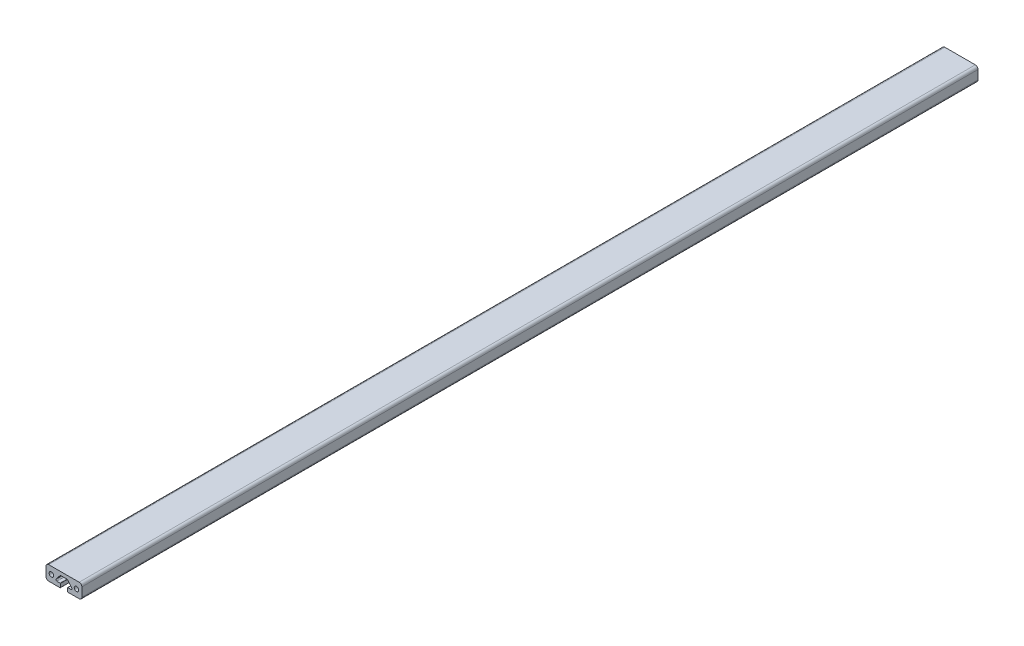
ISO-10303-21;
HEADER;
FILE_DESCRIPTION(('STEP AP214'),'2;1');
FILE_NAME('part.step','',(''),(''),'','','');
FILE_SCHEMA(('AUTOMOTIVE_DESIGN { 1 0 10303 214 1 1 1 1 }'));
ENDSEC;
DATA;
#1=APPLICATION_CONTEXT('core data for automotive mechanical design processes');
#2=APPLICATION_PROTOCOL_DEFINITION('international standard','automotive_design',2000,#1);
#3=PRODUCT_CONTEXT('',#1,'mechanical');
#4=PRODUCT('Part','Part','',(#3));
#5=PRODUCT_RELATED_PRODUCT_CATEGORY('part','',(#4));
#6=PRODUCT_DEFINITION_FORMATION('','',#4);
#7=PRODUCT_DEFINITION_CONTEXT('part definition',#1,'design');
#8=PRODUCT_DEFINITION('design','',#6,#7);
#9=PRODUCT_DEFINITION_SHAPE('','',#8);
#10=(LENGTH_UNIT() NAMED_UNIT(*) SI_UNIT(.MILLI.,.METRE.));
#11=(NAMED_UNIT(*) PLANE_ANGLE_UNIT() SI_UNIT($,.RADIAN.));
#12=(NAMED_UNIT(*) SI_UNIT($,.STERADIAN.) SOLID_ANGLE_UNIT());
#13=UNCERTAINTY_MEASURE_WITH_UNIT(LENGTH_MEASURE(1.E-05),#10,'distance_accuracy_value','');
#14=(GEOMETRIC_REPRESENTATION_CONTEXT(3) GLOBAL_UNCERTAINTY_ASSIGNED_CONTEXT((#13)) GLOBAL_UNIT_ASSIGNED_CONTEXT((#10,
#11,#12)) REPRESENTATION_CONTEXT('',''));
#15=CARTESIAN_POINT('',(0.,0.,0.));
#16=DIRECTION('',(0.,0.,1.));
#17=DIRECTION('',(1.,0.,0.));
#18=AXIS2_PLACEMENT_3D('',#15,#16,#17);
#19=CARTESIAN_POINT('',(-4.00000000000005,0.,1000.));
#20=DIRECTION('',(-1.,0.,0.));
#21=DIRECTION('',(0.,0.,1.));
#22=AXIS2_PLACEMENT_3D('',#19,#20,#21);
#23=PLANE('',#22);
#24=DIRECTION('',(0.,1.,0.));
#25=VECTOR('',#24,1.);
#26=CARTESIAN_POINT('',(-4.00000000000005,0.,0.));
#27=LINE('',#26,#25);
#28=CARTESIAN_POINT('',(-4.00000000000005,0.300000000000012,0.));
#29=VERTEX_POINT('',#28);
#30=CARTESIAN_POINT('',(-4.00000000000005,4.20000000000001,0.));
#31=VERTEX_POINT('',#30);
#32=EDGE_CURVE('E235',#29,#31,#27,.T.);
#33=ORIENTED_EDGE('',*,*,#32,.T.);
#34=DIRECTION('',(0.,0.,-1.));
#35=VECTOR('',#34,1.);
#36=CARTESIAN_POINT('',(-4.00000000000005,4.20000000000001,1000.));
#37=LINE('',#36,#35);
#38=CARTESIAN_POINT('',(-4.00000000000005,4.20000000000001,1000.));
#39=VERTEX_POINT('',#38);
#40=EDGE_CURVE('E11',#39,#31,#37,.T.);
#41=ORIENTED_EDGE('',*,*,#40,.F.);
#42=DIRECTION('',(0.,1.,0.));
#43=VECTOR('',#42,1.);
#44=CARTESIAN_POINT('',(-4.00000000000005,0.,1000.));
#45=LINE('',#44,#43);
#46=CARTESIAN_POINT('',(-4.00000000000005,0.300000000000012,1000.));
#47=VERTEX_POINT('',#46);
#48=EDGE_CURVE('E409',#47,#39,#45,.T.);
#49=ORIENTED_EDGE('',*,*,#48,.F.);
#50=DIRECTION('',(0.,0.,-1.));
#51=VECTOR('',#50,1.);
#52=CARTESIAN_POINT('',(-4.00000000000005,0.300000000000012,1000.));
#53=LINE('',#52,#51);
#54=EDGE_CURVE('E225',#47,#29,#53,.T.);
#55=ORIENTED_EDGE('',*,*,#54,.T.);
#56=EDGE_LOOP('',(#33,#41,#49,#55));
#57=FACE_BOUND('',#56,.T.);
#58=ADVANCED_FACE('F37',(#57),#23,.F.);
#59=CARTESIAN_POINT('',(-4.30000000000004,4.20000000000001,1000.));
#60=DIRECTION('',(0.,0.,-1.));
#61=DIRECTION('',(-1.,0.,0.));
#62=AXIS2_PLACEMENT_3D('',#59,#60,#61);
#63=CYLINDRICAL_SURFACE('',#62,0.299999999999997);
#64=CARTESIAN_POINT('',(-4.30000000000004,4.20000000000001,0.));
#65=DIRECTION('',(0.,0.,1.));
#66=DIRECTION('',(1.,0.,0.));
#67=AXIS2_PLACEMENT_3D('',#64,#65,#66);
#68=CIRCLE('',#67,0.299999999999997);
#69=CARTESIAN_POINT('',(-4.30000000000005,4.50000000000001,0.));
#70=VERTEX_POINT('',#69);
#71=EDGE_CURVE('E238',#31,#70,#68,.T.);
#72=ORIENTED_EDGE('',*,*,#71,.T.);
#73=DIRECTION('',(0.,0.,-1.));
#74=VECTOR('',#73,1.);
#75=CARTESIAN_POINT('',(-4.30000000000005,4.50000000000001,1000.));
#76=LINE('',#75,#74);
#77=CARTESIAN_POINT('',(-4.30000000000005,4.50000000000001,1000.));
#78=VERTEX_POINT('',#77);
#79=EDGE_CURVE('E46',#78,#70,#76,.T.);
#80=ORIENTED_EDGE('',*,*,#79,.F.);
#81=CARTESIAN_POINT('',(-4.30000000000004,4.20000000000001,1000.));
#82=DIRECTION('',(0.,0.,1.));
#83=DIRECTION('',(1.,0.,0.));
#84=AXIS2_PLACEMENT_3D('',#81,#82,#83);
#85=CIRCLE('',#84,0.299999999999997);
#86=EDGE_CURVE('E141',#39,#78,#85,.T.);
#87=ORIENTED_EDGE('',*,*,#86,.F.);
#88=ORIENTED_EDGE('',*,*,#40,.T.);
#89=EDGE_LOOP('',(#72,#80,#87,#88));
#90=FACE_BOUND('',#89,.T.);
#91=ADVANCED_FACE('F424',(#90),#63,.T.);
#92=CARTESIAN_POINT('',(0.,4.50000000000001,1000.));
#93=DIRECTION('',(0.,-1.,0.));
#94=DIRECTION('',(0.,0.,-1.));
#95=AXIS2_PLACEMENT_3D('',#92,#93,#94);
#96=PLANE('',#95);
#97=DIRECTION('',(-1.,0.,0.));
#98=VECTOR('',#97,1.);
#99=CARTESIAN_POINT('',(0.,4.50000000000001,0.));
#100=LINE('',#99,#98);
#101=CARTESIAN_POINT('',(-7.95303120844815,4.50000000000001,0.));
#102=VERTEX_POINT('',#101);
#103=EDGE_CURVE('E240',#70,#102,#100,.T.);
#104=ORIENTED_EDGE('',*,*,#103,.T.);
#105=DIRECTION('',(0.,0.,-1.));
#106=VECTOR('',#105,1.);
#107=CARTESIAN_POINT('',(-7.95303120844815,4.50000000000001,1000.));
#108=LINE('',#107,#106);
#109=CARTESIAN_POINT('',(-7.95303120844815,4.50000000000001,1000.));
#110=VERTEX_POINT('',#109);
#111=EDGE_CURVE('E338',#110,#102,#108,.T.);
#112=ORIENTED_EDGE('',*,*,#111,.F.);
#113=DIRECTION('',(-1.,0.,0.));
#114=VECTOR('',#113,1.);
#115=CARTESIAN_POINT('',(0.,4.50000000000001,1000.));
#116=LINE('',#115,#114);
#117=EDGE_CURVE('E346',#78,#110,#116,.T.);
#118=ORIENTED_EDGE('',*,*,#117,.F.);
#119=ORIENTED_EDGE('',*,*,#79,.T.);
#120=EDGE_LOOP('',(#104,#112,#118,#119));
#121=FACE_BOUND('',#120,.T.);
#122=ADVANCED_FACE('F344',(#121),#96,.F.);
#123=CARTESIAN_POINT('',(-7.95303120844816,5.50000000000001,1000.));
#124=DIRECTION('',(0.,0.,-1.));
#125=DIRECTION('',(-1.,0.,0.));
#126=AXIS2_PLACEMENT_3D('',#123,#124,#125);
#127=CYLINDRICAL_SURFACE('',#126,0.99999999999999);
#128=CARTESIAN_POINT('',(-7.95303120844816,5.50000000000001,0.));
#129=DIRECTION('',(0.,0.,1.));
#130=DIRECTION('',(1.,0.,0.));
#131=AXIS2_PLACEMENT_3D('',#128,#129,#130);
#132=CIRCLE('',#131,0.99999999999999);
#133=CARTESIAN_POINT('',(-8.74183149862666,6.11464957676247,0.));
#134=VERTEX_POINT('',#133);
#135=EDGE_CURVE('E242',#102,#134,#132,.F.);
#136=ORIENTED_EDGE('',*,*,#135,.T.);
#137=DIRECTION('',(0.,0.,-1.));
#138=VECTOR('',#137,1.);
#139=CARTESIAN_POINT('',(-8.74183149862666,6.11464957676247,1000.));
#140=LINE('',#139,#138);
#141=CARTESIAN_POINT('',(-8.74183149862666,6.11464957676247,1000.));
#142=VERTEX_POINT('',#141);
#143=EDGE_CURVE('E335',#142,#134,#140,.T.);
#144=ORIENTED_EDGE('',*,*,#143,.F.);
#145=CARTESIAN_POINT('',(-7.95303120844816,5.50000000000001,1000.));
#146=DIRECTION('',(0.,0.,1.));
#147=DIRECTION('',(1.,0.,0.));
#148=AXIS2_PLACEMENT_3D('',#145,#146,#147);
#149=CIRCLE('',#148,0.99999999999999);
#150=EDGE_CURVE('E364',#110,#142,#149,.F.);
#151=ORIENTED_EDGE('',*,*,#150,.F.);
#152=ORIENTED_EDGE('',*,*,#111,.T.);
#153=EDGE_LOOP('',(#136,#144,#151,#152));
#154=FACE_BOUND('',#153,.T.);
#155=ADVANCED_FACE('F355',(#154),#127,.F.);
#156=CARTESIAN_POINT('',(-8.40381991814463,6.54843110504774,1000.));
#157=DIRECTION('',(-0.788800290178514,0.614649576762476,0.));
#158=DIRECTION('',(-0.614649576762476,-0.788800290178514,0.));
#159=AXIS2_PLACEMENT_3D('',#156,#157,#158);
#160=PLANE('',#159);
#161=DIRECTION('',(0.614649576762476,0.788800290178514,0.));
#162=VECTOR('',#161,1.);
#163=CARTESIAN_POINT('',(-8.40381991814463,6.54843110504774,0.));
#164=LINE('',#163,#162);
#165=CARTESIAN_POINT('',(-4.30027305706823,11.8146495767625,0.));
#166=VERTEX_POINT('',#165);
#167=EDGE_CURVE('E244',#134,#166,#164,.T.);
#168=ORIENTED_EDGE('',*,*,#167,.T.);
#169=DIRECTION('',(0.,0.,-1.));
#170=VECTOR('',#169,1.);
#171=CARTESIAN_POINT('',(-4.30027305706823,11.8146495767625,1000.));
#172=LINE('',#171,#170);
#173=CARTESIAN_POINT('',(-4.30027305706823,11.8146495767625,1000.));
#174=VERTEX_POINT('',#173);
#175=EDGE_CURVE('E332',#174,#166,#172,.T.);
#176=ORIENTED_EDGE('',*,*,#175,.F.);
#177=DIRECTION('',(0.614649576762476,0.788800290178514,0.));
#178=VECTOR('',#177,1.);
#179=CARTESIAN_POINT('',(-8.40381991814463,6.54843110504774,1000.));
#180=LINE('',#179,#178);
#181=EDGE_CURVE('E361',#142,#174,#180,.T.);
#182=ORIENTED_EDGE('',*,*,#181,.F.);
#183=ORIENTED_EDGE('',*,*,#143,.T.);
#184=EDGE_LOOP('',(#168,#176,#182,#183));
#185=FACE_BOUND('',#184,.T.);
#186=ADVANCED_FACE('F359',(#185),#160,.F.);
#187=CARTESIAN_POINT('',(-3.51147276688973,11.2,1000.));
#188=DIRECTION('',(0.,0.,-1.));
#189=DIRECTION('',(-1.,0.,0.));
#190=AXIS2_PLACEMENT_3D('',#187,#188,#189);
#191=CYLINDRICAL_SURFACE('',#190,0.999999999999991);
#192=CARTESIAN_POINT('',(-3.51147276688973,11.2,0.));
#193=DIRECTION('',(0.,0.,1.));
#194=DIRECTION('',(1.,0.,0.));
#195=AXIS2_PLACEMENT_3D('',#192,#193,#194);
#196=CIRCLE('',#195,0.999999999999991);
#197=CARTESIAN_POINT('',(-3.51147276688972,12.2,0.));
#198=VERTEX_POINT('',#197);
#199=EDGE_CURVE('E246',#166,#198,#196,.F.);
#200=ORIENTED_EDGE('',*,*,#199,.T.);
#201=DIRECTION('',(0.,0.,-1.));
#202=VECTOR('',#201,1.);
#203=CARTESIAN_POINT('',(-3.51147276688972,12.2,1000.));
#204=LINE('',#203,#202);
#205=CARTESIAN_POINT('',(-3.51147276688972,12.2,1000.));
#206=VERTEX_POINT('',#205);
#207=EDGE_CURVE('E329',#206,#198,#204,.T.);
#208=ORIENTED_EDGE('',*,*,#207,.F.);
#209=CARTESIAN_POINT('',(-3.51147276688973,11.2,1000.));
#210=DIRECTION('',(0.,0.,1.));
#211=DIRECTION('',(1.,0.,0.));
#212=AXIS2_PLACEMENT_3D('',#209,#210,#211);
#213=CIRCLE('',#212,0.999999999999991);
#214=EDGE_CURVE('E363',#174,#206,#213,.F.);
#215=ORIENTED_EDGE('',*,*,#214,.F.);
#216=ORIENTED_EDGE('',*,*,#175,.T.);
#217=EDGE_LOOP('',(#200,#208,#215,#216));
#218=FACE_BOUND('',#217,.T.);
#219=ADVANCED_FACE('F630',(#218),#191,.F.);
#220=CARTESIAN_POINT('',(0.,12.2,1000.));
#221=DIRECTION('',(0.,1.,0.));
#222=DIRECTION('',(0.,0.,1.));
#223=AXIS2_PLACEMENT_3D('',#220,#221,#222);
#224=PLANE('',#223);
#225=DIRECTION('',(1.,0.,0.));
#226=VECTOR('',#225,1.);
#227=CARTESIAN_POINT('',(0.,12.2,0.));
#228=LINE('',#227,#226);
#229=CARTESIAN_POINT('',(3.51147276688964,12.2,0.));
#230=VERTEX_POINT('',#229);
#231=EDGE_CURVE('E248',#198,#230,#228,.T.);
#232=ORIENTED_EDGE('',*,*,#231,.T.);
#233=DIRECTION('',(0.,0.,-1.));
#234=VECTOR('',#233,1.);
#235=CARTESIAN_POINT('',(3.51147276688964,12.2,1000.));
#236=LINE('',#235,#234);
#237=CARTESIAN_POINT('',(3.51147276688964,12.2,1000.));
#238=VERTEX_POINT('',#237);
#239=EDGE_CURVE('E326',#238,#230,#236,.T.);
#240=ORIENTED_EDGE('',*,*,#239,.F.);
#241=DIRECTION('',(1.,0.,0.));
#242=VECTOR('',#241,1.);
#243=CARTESIAN_POINT('',(0.,12.2,1000.));
#244=LINE('',#243,#242);
#245=EDGE_CURVE('E366',#206,#238,#244,.T.);
#246=ORIENTED_EDGE('',*,*,#245,.F.);
#247=ORIENTED_EDGE('',*,*,#207,.T.);
#248=EDGE_LOOP('',(#232,#240,#246,#247));
#249=FACE_BOUND('',#248,.T.);
#250=ADVANCED_FACE('F620',(#249),#224,.F.);
#251=CARTESIAN_POINT('',(3.51147276688965,11.2,1000.));
#252=DIRECTION('',(0.,0.,-1.));
#253=DIRECTION('',(-1.,0.,0.));
#254=AXIS2_PLACEMENT_3D('',#251,#252,#253);
#255=CYLINDRICAL_SURFACE('',#254,0.999999999999999);
#256=CARTESIAN_POINT('',(3.51147276688965,11.2,0.));
#257=DIRECTION('',(0.,0.,1.));
#258=DIRECTION('',(1.,0.,0.));
#259=AXIS2_PLACEMENT_3D('',#256,#257,#258);
#260=CIRCLE('',#259,0.999999999999999);
#261=CARTESIAN_POINT('',(4.30027305706817,11.8146495767625,0.));
#262=VERTEX_POINT('',#261);
#263=EDGE_CURVE('E250',#230,#262,#260,.F.);
#264=ORIENTED_EDGE('',*,*,#263,.T.);
#265=DIRECTION('',(0.,0.,-1.));
#266=VECTOR('',#265,1.);
#267=CARTESIAN_POINT('',(4.30027305706817,11.8146495767625,1000.));
#268=LINE('',#267,#266);
#269=CARTESIAN_POINT('',(4.30027305706817,11.8146495767625,1000.));
#270=VERTEX_POINT('',#269);
#271=EDGE_CURVE('E323',#270,#262,#268,.T.);
#272=ORIENTED_EDGE('',*,*,#271,.F.);
#273=CARTESIAN_POINT('',(3.51147276688965,11.2,1000.));
#274=DIRECTION('',(0.,0.,1.));
#275=DIRECTION('',(1.,0.,0.));
#276=AXIS2_PLACEMENT_3D('',#273,#274,#275);
#277=CIRCLE('',#276,0.999999999999999);
#278=EDGE_CURVE('E372',#238,#270,#277,.F.);
#279=ORIENTED_EDGE('',*,*,#278,.F.);
#280=ORIENTED_EDGE('',*,*,#239,.T.);
#281=EDGE_LOOP('',(#264,#272,#279,#280));
#282=FACE_BOUND('',#281,.T.);
#283=ADVANCED_FACE('F610',(#282),#255,.F.);
#284=CARTESIAN_POINT('',(8.4038199181446,6.54843110504772,1000.));
#285=DIRECTION('',(0.788800290178514,0.614649576762477,0.));
#286=DIRECTION('',(-0.614649576762477,0.788800290178514,0.));
#287=AXIS2_PLACEMENT_3D('',#284,#285,#286);
#288=PLANE('',#287);
#289=DIRECTION('',(0.614649576762477,-0.788800290178514,0.));
#290=VECTOR('',#289,1.);
#291=CARTESIAN_POINT('',(8.4038199181446,6.54843110504772,0.));
#292=LINE('',#291,#290);
#293=CARTESIAN_POINT('',(8.74183149862659,6.11464957676248,0.));
#294=VERTEX_POINT('',#293);
#295=EDGE_CURVE('E252',#262,#294,#292,.T.);
#296=ORIENTED_EDGE('',*,*,#295,.T.);
#297=DIRECTION('',(0.,0.,-1.));
#298=VECTOR('',#297,1.);
#299=CARTESIAN_POINT('',(8.74183149862659,6.11464957676248,1000.));
#300=LINE('',#299,#298);
#301=CARTESIAN_POINT('',(8.74183149862659,6.11464957676248,1000.));
#302=VERTEX_POINT('',#301);
#303=EDGE_CURVE('E320',#302,#294,#300,.T.);
#304=ORIENTED_EDGE('',*,*,#303,.F.);
#305=DIRECTION('',(0.614649576762477,-0.788800290178514,0.));
#306=VECTOR('',#305,1.);
#307=CARTESIAN_POINT('',(8.4038199181446,6.54843110504772,1000.));
#308=LINE('',#307,#306);
#309=EDGE_CURVE('E374',#270,#302,#308,.T.);
#310=ORIENTED_EDGE('',*,*,#309,.F.);
#311=ORIENTED_EDGE('',*,*,#271,.T.);
#312=EDGE_LOOP('',(#296,#304,#310,#311));
#313=FACE_BOUND('',#312,.T.);
#314=ADVANCED_FACE('F600',(#313),#288,.F.);
#315=CARTESIAN_POINT('',(7.95303120844808,5.50000000000001,1000.));
#316=DIRECTION('',(0.,0.,-1.));
#317=DIRECTION('',(-1.,0.,0.));
#318=AXIS2_PLACEMENT_3D('',#315,#316,#317);
#319=CYLINDRICAL_SURFACE('',#318,0.999999999999999);
#320=CARTESIAN_POINT('',(7.95303120844808,5.50000000000001,0.));
#321=DIRECTION('',(0.,0.,1.));
#322=DIRECTION('',(1.,0.,0.));
#323=AXIS2_PLACEMENT_3D('',#320,#321,#322);
#324=CIRCLE('',#323,0.999999999999999);
#325=CARTESIAN_POINT('',(7.95303120844806,4.50000000000001,0.));
#326=VERTEX_POINT('',#325);
#327=EDGE_CURVE('E254',#294,#326,#324,.F.);
#328=ORIENTED_EDGE('',*,*,#327,.T.);
#329=DIRECTION('',(0.,0.,-1.));
#330=VECTOR('',#329,1.);
#331=CARTESIAN_POINT('',(7.95303120844806,4.50000000000001,1000.));
#332=LINE('',#331,#330);
#333=CARTESIAN_POINT('',(7.95303120844806,4.50000000000001,1000.));
#334=VERTEX_POINT('',#333);
#335=EDGE_CURVE('E317',#334,#326,#332,.T.);
#336=ORIENTED_EDGE('',*,*,#335,.F.);
#337=CARTESIAN_POINT('',(7.95303120844808,5.50000000000001,1000.));
#338=DIRECTION('',(0.,0.,1.));
#339=DIRECTION('',(1.,0.,0.));
#340=AXIS2_PLACEMENT_3D('',#337,#338,#339);
#341=CIRCLE('',#340,0.999999999999999);
#342=EDGE_CURVE('E376',#302,#334,#341,.F.);
#343=ORIENTED_EDGE('',*,*,#342,.F.);
#344=ORIENTED_EDGE('',*,*,#303,.T.);
#345=EDGE_LOOP('',(#328,#336,#343,#344));
#346=FACE_BOUND('',#345,.T.);
#347=ADVANCED_FACE('F590',(#346),#319,.F.);
#348=CARTESIAN_POINT('',(0.,4.50000000000001,1000.));
#349=DIRECTION('',(0.,-1.,0.));
#350=DIRECTION('',(0.,0.,-1.));
#351=AXIS2_PLACEMENT_3D('',#348,#349,#350);
#352=PLANE('',#351);
#353=DIRECTION('',(-1.,0.,0.));
#354=VECTOR('',#353,1.);
#355=CARTESIAN_POINT('',(0.,4.50000000000001,0.));
#356=LINE('',#355,#354);
#357=CARTESIAN_POINT('',(4.29999999999997,4.50000000000001,0.));
#358=VERTEX_POINT('',#357);
#359=EDGE_CURVE('E256',#326,#358,#356,.T.);
#360=ORIENTED_EDGE('',*,*,#359,.T.);
#361=DIRECTION('',(0.,0.,-1.));
#362=VECTOR('',#361,1.);
#363=CARTESIAN_POINT('',(4.29999999999997,4.50000000000001,1000.));
#364=LINE('',#363,#362);
#365=CARTESIAN_POINT('',(4.29999999999997,4.50000000000001,1000.));
#366=VERTEX_POINT('',#365);
#367=EDGE_CURVE('E314',#366,#358,#364,.T.);
#368=ORIENTED_EDGE('',*,*,#367,.F.);
#369=DIRECTION('',(-1.,0.,0.));
#370=VECTOR('',#369,1.);
#371=CARTESIAN_POINT('',(0.,4.50000000000001,1000.));
#372=LINE('',#371,#370);
#373=EDGE_CURVE('E378',#334,#366,#372,.T.);
#374=ORIENTED_EDGE('',*,*,#373,.F.);
#375=ORIENTED_EDGE('',*,*,#335,.T.);
#376=EDGE_LOOP('',(#360,#368,#374,#375));
#377=FACE_BOUND('',#376,.T.);
#378=ADVANCED_FACE('F580',(#377),#352,.F.);
#379=CARTESIAN_POINT('',(4.29999999999996,4.20000000000001,1000.));
#380=DIRECTION('',(0.,0.,-1.));
#381=DIRECTION('',(-1.,0.,0.));
#382=AXIS2_PLACEMENT_3D('',#379,#380,#381);
#383=CYLINDRICAL_SURFACE('',#382,0.299999999999997);
#384=CARTESIAN_POINT('',(4.29999999999996,4.20000000000001,0.));
#385=DIRECTION('',(0.,0.,1.));
#386=DIRECTION('',(1.,0.,0.));
#387=AXIS2_PLACEMENT_3D('',#384,#385,#386);
#388=CIRCLE('',#387,0.299999999999997);
#389=CARTESIAN_POINT('',(3.99999999999996,4.20000000000001,0.));
#390=VERTEX_POINT('',#389);
#391=EDGE_CURVE('E258',#358,#390,#388,.T.);
#392=ORIENTED_EDGE('',*,*,#391,.T.);
#393=DIRECTION('',(0.,0.,-1.));
#394=VECTOR('',#393,1.);
#395=CARTESIAN_POINT('',(3.99999999999996,4.20000000000001,1000.));
#396=LINE('',#395,#394);
#397=CARTESIAN_POINT('',(3.99999999999996,4.20000000000001,1000.));
#398=VERTEX_POINT('',#397);
#399=EDGE_CURVE('E311',#398,#390,#396,.T.);
#400=ORIENTED_EDGE('',*,*,#399,.F.);
#401=CARTESIAN_POINT('',(4.29999999999996,4.20000000000001,1000.));
#402=DIRECTION('',(0.,0.,1.));
#403=DIRECTION('',(1.,0.,0.));
#404=AXIS2_PLACEMENT_3D('',#401,#402,#403);
#405=CIRCLE('',#404,0.299999999999997);
#406=EDGE_CURVE('E380',#366,#398,#405,.T.);
#407=ORIENTED_EDGE('',*,*,#406,.F.);
#408=ORIENTED_EDGE('',*,*,#367,.T.);
#409=EDGE_LOOP('',(#392,#400,#407,#408));
#410=FACE_BOUND('',#409,.T.);
#411=ADVANCED_FACE('F570',(#410),#383,.T.);
#412=CARTESIAN_POINT('',(3.99999999999996,0.,1000.));
#413=DIRECTION('',(1.,0.,0.));
#414=DIRECTION('',(0.,0.,-1.));
#415=AXIS2_PLACEMENT_3D('',#412,#413,#414);
#416=PLANE('',#415);
#417=DIRECTION('',(0.,-1.,0.));
#418=VECTOR('',#417,1.);
#419=CARTESIAN_POINT('',(3.99999999999996,0.,0.));
#420=LINE('',#419,#418);
#421=CARTESIAN_POINT('',(3.99999999999996,0.300000000000012,0.));
#422=VERTEX_POINT('',#421);
#423=EDGE_CURVE('E260',#390,#422,#420,.T.);
#424=ORIENTED_EDGE('',*,*,#423,.T.);
#425=DIRECTION('',(0.,0.,-1.));
#426=VECTOR('',#425,1.);
#427=CARTESIAN_POINT('',(3.99999999999996,0.300000000000012,1000.));
#428=LINE('',#427,#426);
#429=CARTESIAN_POINT('',(3.99999999999996,0.300000000000012,1000.));
#430=VERTEX_POINT('',#429);
#431=EDGE_CURVE('E308',#430,#422,#428,.T.);
#432=ORIENTED_EDGE('',*,*,#431,.F.);
#433=DIRECTION('',(0.,-1.,0.));
#434=VECTOR('',#433,1.);
#435=CARTESIAN_POINT('',(3.99999999999996,0.,1000.));
#436=LINE('',#435,#434);
#437=EDGE_CURVE('E382',#398,#430,#436,.T.);
#438=ORIENTED_EDGE('',*,*,#437,.F.);
#439=ORIENTED_EDGE('',*,*,#399,.T.);
#440=EDGE_LOOP('',(#424,#432,#438,#439));
#441=FACE_BOUND('',#440,.T.);
#442=ADVANCED_FACE('F560',(#441),#416,.F.);
#443=CARTESIAN_POINT('',(4.29999999999996,0.30000000000001,1000.));
#444=DIRECTION('',(0.,0.,-1.));
#445=DIRECTION('',(-1.,0.,0.));
#446=AXIS2_PLACEMENT_3D('',#443,#444,#445);
#447=CYLINDRICAL_SURFACE('',#446,0.299999999999997);
#448=CARTESIAN_POINT('',(4.29999999999996,0.30000000000001,0.));
#449=DIRECTION('',(0.,0.,1.));
#450=DIRECTION('',(1.,0.,0.));
#451=AXIS2_PLACEMENT_3D('',#448,#449,#450);
#452=CIRCLE('',#451,0.299999999999997);
#453=CARTESIAN_POINT('',(4.29999999999997,0.,0.));
#454=VERTEX_POINT('',#453);
#455=EDGE_CURVE('E262',#422,#454,#452,.T.);
#456=ORIENTED_EDGE('',*,*,#455,.T.);
#457=DIRECTION('',(0.,0.,-1.));
#458=VECTOR('',#457,1.);
#459=CARTESIAN_POINT('',(4.29999999999997,0.,1000.));
#460=LINE('',#459,#458);
#461=CARTESIAN_POINT('',(4.29999999999997,0.,1000.));
#462=VERTEX_POINT('',#461);
#463=EDGE_CURVE('E305',#462,#454,#460,.T.);
#464=ORIENTED_EDGE('',*,*,#463,.F.);
#465=CARTESIAN_POINT('',(4.29999999999996,0.30000000000001,1000.));
#466=DIRECTION('',(0.,0.,1.));
#467=DIRECTION('',(1.,0.,0.));
#468=AXIS2_PLACEMENT_3D('',#465,#466,#467);
#469=CIRCLE('',#468,0.299999999999997);
#470=EDGE_CURVE('E384',#430,#462,#469,.T.);
#471=ORIENTED_EDGE('',*,*,#470,.F.);
#472=ORIENTED_EDGE('',*,*,#431,.T.);
#473=EDGE_LOOP('',(#456,#464,#471,#472));
#474=FACE_BOUND('',#473,.T.);
#475=ADVANCED_FACE('F549',(#474),#447,.T.);
#476=CARTESIAN_POINT('',(0.,0.,1000.));
#477=DIRECTION('',(0.,1.,0.));
#478=DIRECTION('',(0.,0.,1.));
#479=AXIS2_PLACEMENT_3D('',#476,#477,#478);
#480=PLANE('',#479);
#481=DIRECTION('',(1.,0.,0.));
#482=VECTOR('',#481,1.);
#483=CARTESIAN_POINT('',(0.,0.,0.));
#484=LINE('',#483,#482);
#485=CARTESIAN_POINT('',(17.,0.,0.));
#486=VERTEX_POINT('',#485);
#487=EDGE_CURVE('E264',#454,#486,#484,.T.);
#488=ORIENTED_EDGE('',*,*,#487,.T.);
#489=DIRECTION('',(0.,0.,-1.));
#490=VECTOR('',#489,1.);
#491=CARTESIAN_POINT('',(17.,0.,1000.));
#492=LINE('',#491,#490);
#493=CARTESIAN_POINT('',(17.,0.,1000.));
#494=VERTEX_POINT('',#493);
#495=EDGE_CURVE('E303',#494,#486,#492,.T.);
#496=ORIENTED_EDGE('',*,*,#495,.F.);
#497=DIRECTION('',(1.,0.,0.));
#498=VECTOR('',#497,1.);
#499=CARTESIAN_POINT('',(0.,0.,1000.));
#500=LINE('',#499,#498);
#501=EDGE_CURVE('E386',#462,#494,#500,.T.);
#502=ORIENTED_EDGE('',*,*,#501,.F.);
#503=ORIENTED_EDGE('',*,*,#463,.T.);
#504=EDGE_LOOP('',(#488,#496,#502,#503));
#505=FACE_BOUND('',#504,.T.);
#506=ADVANCED_FACE('F539',(#505),#480,.F.);
#507=CARTESIAN_POINT('',(17.,3.,1000.));
#508=DIRECTION('',(0.,0.,-1.));
#509=DIRECTION('',(-1.,0.,0.));
#510=AXIS2_PLACEMENT_3D('',#507,#508,#509);
#511=CYLINDRICAL_SURFACE('',#510,3.);
#512=CARTESIAN_POINT('',(17.,3.,0.));
#513=DIRECTION('',(0.,0.,1.));
#514=DIRECTION('',(1.,0.,0.));
#515=AXIS2_PLACEMENT_3D('',#512,#513,#514);
#516=CIRCLE('',#515,3.);
#517=CARTESIAN_POINT('',(20.,3.00000000000002,0.));
#518=VERTEX_POINT('',#517);
#519=EDGE_CURVE('E267',#518,#486,#516,.F.);
#520=ORIENTED_EDGE('',*,*,#519,.F.);
#521=DIRECTION('',(0.,0.,-1.));
#522=VECTOR('',#521,1.);
#523=CARTESIAN_POINT('',(20.,3.00000000000002,1000.));
#524=LINE('',#523,#522);
#525=CARTESIAN_POINT('',(20.,3.00000000000002,1000.));
#526=VERTEX_POINT('',#525);
#527=EDGE_CURVE('E301',#526,#518,#524,.T.);
#528=ORIENTED_EDGE('',*,*,#527,.F.);
#529=CARTESIAN_POINT('',(17.,3.,1000.));
#530=DIRECTION('',(0.,0.,1.));
#531=DIRECTION('',(1.,0.,0.));
#532=AXIS2_PLACEMENT_3D('',#529,#530,#531);
#533=CIRCLE('',#532,3.);
#534=EDGE_CURVE('E388',#526,#494,#533,.F.);
#535=ORIENTED_EDGE('',*,*,#534,.T.);
#536=ORIENTED_EDGE('',*,*,#495,.T.);
#537=EDGE_LOOP('',(#520,#528,#535,#536));
#538=FACE_BOUND('',#537,.T.);
#539=ADVANCED_FACE('F529',(#538),#511,.T.);
#540=CARTESIAN_POINT('',(20.,0.,1000.));
#541=DIRECTION('',(1.,0.,0.));
#542=DIRECTION('',(0.,0.,-1.));
#543=AXIS2_PLACEMENT_3D('',#540,#541,#542);
#544=PLANE('',#543);
#545=DIRECTION('',(0.,-1.,0.));
#546=VECTOR('',#545,1.);
#547=CARTESIAN_POINT('',(20.,0.,0.));
#548=LINE('',#547,#546);
#549=CARTESIAN_POINT('',(20.,13.,0.));
#550=VERTEX_POINT('',#549);
#551=EDGE_CURVE('E270',#550,#518,#548,.T.);
#552=ORIENTED_EDGE('',*,*,#551,.F.);
#553=DIRECTION('',(0.,0.,-1.));
#554=VECTOR('',#553,1.);
#555=CARTESIAN_POINT('',(20.,13.,1000.));
#556=LINE('',#555,#554);
#557=CARTESIAN_POINT('',(20.,13.,1000.));
#558=VERTEX_POINT('',#557);
#559=EDGE_CURVE('E299',#558,#550,#556,.T.);
#560=ORIENTED_EDGE('',*,*,#559,.F.);
#561=DIRECTION('',(0.,-1.,0.));
#562=VECTOR('',#561,1.);
#563=CARTESIAN_POINT('',(20.,0.,1000.));
#564=LINE('',#563,#562);
#565=EDGE_CURVE('E391',#558,#526,#564,.T.);
#566=ORIENTED_EDGE('',*,*,#565,.T.);
#567=ORIENTED_EDGE('',*,*,#527,.T.);
#568=EDGE_LOOP('',(#552,#560,#566,#567));
#569=FACE_BOUND('',#568,.T.);
#570=ADVANCED_FACE('F519',(#569),#544,.T.);
#571=CARTESIAN_POINT('',(17.,13.,1000.));
#572=DIRECTION('',(0.,0.,-1.));
#573=DIRECTION('',(-1.,0.,0.));
#574=AXIS2_PLACEMENT_3D('',#571,#572,#573);
#575=CYLINDRICAL_SURFACE('',#574,3.);
#576=CARTESIAN_POINT('',(17.,13.,0.));
#577=DIRECTION('',(0.,0.,1.));
#578=DIRECTION('',(1.,0.,0.));
#579=AXIS2_PLACEMENT_3D('',#576,#577,#578);
#580=CIRCLE('',#579,3.);
#581=CARTESIAN_POINT('',(17.,16.,0.));
#582=VERTEX_POINT('',#581);
#583=EDGE_CURVE('E273',#582,#550,#580,.F.);
#584=ORIENTED_EDGE('',*,*,#583,.F.);
#585=DIRECTION('',(0.,0.,-1.));
#586=VECTOR('',#585,1.);
#587=CARTESIAN_POINT('',(17.,16.,1000.));
#588=LINE('',#587,#586);
#589=CARTESIAN_POINT('',(17.,16.,1000.));
#590=VERTEX_POINT('',#589);
#591=EDGE_CURVE('E297',#590,#582,#588,.T.);
#592=ORIENTED_EDGE('',*,*,#591,.F.);
#593=CARTESIAN_POINT('',(17.,13.,1000.));
#594=DIRECTION('',(0.,0.,1.));
#595=DIRECTION('',(1.,0.,0.));
#596=AXIS2_PLACEMENT_3D('',#593,#594,#595);
#597=CIRCLE('',#596,3.);
#598=EDGE_CURVE('E394',#590,#558,#597,.F.);
#599=ORIENTED_EDGE('',*,*,#598,.T.);
#600=ORIENTED_EDGE('',*,*,#559,.T.);
#601=EDGE_LOOP('',(#584,#592,#599,#600));
#602=FACE_BOUND('',#601,.T.);
#603=ADVANCED_FACE('F509',(#602),#575,.T.);
#604=CARTESIAN_POINT('',(0.,16.,1000.));
#605=DIRECTION('',(0.,1.,0.));
#606=DIRECTION('',(0.,0.,1.));
#607=AXIS2_PLACEMENT_3D('',#604,#605,#606);
#608=PLANE('',#607);
#609=DIRECTION('',(1.,0.,0.));
#610=VECTOR('',#609,1.);
#611=CARTESIAN_POINT('',(0.,16.,0.));
#612=LINE('',#611,#610);
#613=CARTESIAN_POINT('',(-17.,16.,0.));
#614=VERTEX_POINT('',#613);
#615=EDGE_CURVE('E276',#614,#582,#612,.T.);
#616=ORIENTED_EDGE('',*,*,#615,.F.);
#617=DIRECTION('',(0.,0.,-1.));
#618=VECTOR('',#617,1.);
#619=CARTESIAN_POINT('',(-17.,16.,1000.));
#620=LINE('',#619,#618);
#621=CARTESIAN_POINT('',(-17.,16.,1000.));
#622=VERTEX_POINT('',#621);
#623=EDGE_CURVE('E295',#622,#614,#620,.T.);
#624=ORIENTED_EDGE('',*,*,#623,.F.);
#625=DIRECTION('',(1.,0.,0.));
#626=VECTOR('',#625,1.);
#627=CARTESIAN_POINT('',(0.,16.,1000.));
#628=LINE('',#627,#626);
#629=EDGE_CURVE('E397',#622,#590,#628,.T.);
#630=ORIENTED_EDGE('',*,*,#629,.T.);
#631=ORIENTED_EDGE('',*,*,#591,.T.);
#632=EDGE_LOOP('',(#616,#624,#630,#631));
#633=FACE_BOUND('',#632,.T.);
#634=ADVANCED_FACE('F499',(#633),#608,.T.);
#635=CARTESIAN_POINT('',(-17.,13.,1000.));
#636=DIRECTION('',(0.,0.,-1.));
#637=DIRECTION('',(-1.,0.,0.));
#638=AXIS2_PLACEMENT_3D('',#635,#636,#637);
#639=CYLINDRICAL_SURFACE('',#638,3.);
#640=CARTESIAN_POINT('',(-17.,13.,0.));
#641=DIRECTION('',(0.,0.,1.));
#642=DIRECTION('',(1.,0.,0.));
#643=AXIS2_PLACEMENT_3D('',#640,#641,#642);
#644=CIRCLE('',#643,3.);
#645=CARTESIAN_POINT('',(-20.,13.,0.));
#646=VERTEX_POINT('',#645);
#647=EDGE_CURVE('E279',#646,#614,#644,.F.);
#648=ORIENTED_EDGE('',*,*,#647,.F.);
#649=DIRECTION('',(0.,0.,-1.));
#650=VECTOR('',#649,1.);
#651=CARTESIAN_POINT('',(-20.,13.,1000.));
#652=LINE('',#651,#650);
#653=CARTESIAN_POINT('',(-20.,13.,1000.));
#654=VERTEX_POINT('',#653);
#655=EDGE_CURVE('E293',#654,#646,#652,.T.);
#656=ORIENTED_EDGE('',*,*,#655,.F.);
#657=CARTESIAN_POINT('',(-17.,13.,1000.));
#658=DIRECTION('',(0.,0.,1.));
#659=DIRECTION('',(1.,0.,0.));
#660=AXIS2_PLACEMENT_3D('',#657,#658,#659);
#661=CIRCLE('',#660,3.);
#662=EDGE_CURVE('E400',#654,#622,#661,.F.);
#663=ORIENTED_EDGE('',*,*,#662,.T.);
#664=ORIENTED_EDGE('',*,*,#623,.T.);
#665=EDGE_LOOP('',(#648,#656,#663,#664));
#666=FACE_BOUND('',#665,.T.);
#667=ADVANCED_FACE('F490',(#666),#639,.T.);
#668=CARTESIAN_POINT('',(-20.,0.,1000.));
#669=DIRECTION('',(-1.,0.,0.));
#670=DIRECTION('',(0.,0.,1.));
#671=AXIS2_PLACEMENT_3D('',#668,#669,#670);
#672=PLANE('',#671);
#673=DIRECTION('',(0.,1.,0.));
#674=VECTOR('',#673,1.);
#675=CARTESIAN_POINT('',(-20.,0.,0.));
#676=LINE('',#675,#674);
#677=CARTESIAN_POINT('',(-20.,3.00000000000002,0.));
#678=VERTEX_POINT('',#677);
#679=EDGE_CURVE('E282',#678,#646,#676,.T.);
#680=ORIENTED_EDGE('',*,*,#679,.F.);
#681=DIRECTION('',(0.,0.,-1.));
#682=VECTOR('',#681,1.);
#683=CARTESIAN_POINT('',(-20.,3.00000000000002,1000.));
#684=LINE('',#683,#682);
#685=CARTESIAN_POINT('',(-20.,3.00000000000002,1000.));
#686=VERTEX_POINT('',#685);
#687=EDGE_CURVE('E214',#686,#678,#684,.T.);
#688=ORIENTED_EDGE('',*,*,#687,.F.);
#689=DIRECTION('',(0.,1.,0.));
#690=VECTOR('',#689,1.);
#691=CARTESIAN_POINT('',(-20.,0.,1000.));
#692=LINE('',#691,#690);
#693=EDGE_CURVE('E221',#686,#654,#692,.T.);
#694=ORIENTED_EDGE('',*,*,#693,.T.);
#695=ORIENTED_EDGE('',*,*,#655,.T.);
#696=EDGE_LOOP('',(#680,#688,#694,#695));
#697=FACE_BOUND('',#696,.T.);
#698=ADVANCED_FACE('F404',(#697),#672,.T.);
#699=CARTESIAN_POINT('',(-17.,3.,1000.));
#700=DIRECTION('',(0.,0.,-1.));
#701=DIRECTION('',(-1.,0.,0.));
#702=AXIS2_PLACEMENT_3D('',#699,#700,#701);
#703=CYLINDRICAL_SURFACE('',#702,3.);
#704=CARTESIAN_POINT('',(-17.,3.,0.));
#705=DIRECTION('',(0.,0.,1.));
#706=DIRECTION('',(1.,0.,0.));
#707=AXIS2_PLACEMENT_3D('',#704,#705,#706);
#708=CIRCLE('',#707,3.);
#709=CARTESIAN_POINT('',(-17.,0.,0.));
#710=VERTEX_POINT('',#709);
#711=EDGE_CURVE('E209',#710,#678,#708,.F.);
#712=ORIENTED_EDGE('',*,*,#711,.F.);
#713=DIRECTION('',(0.,0.,-1.));
#714=VECTOR('',#713,1.);
#715=CARTESIAN_POINT('',(-17.,0.,1000.));
#716=LINE('',#715,#714);
#717=CARTESIAN_POINT('',(-17.,0.,1000.));
#718=VERTEX_POINT('',#717);
#719=EDGE_CURVE('E204',#718,#710,#716,.T.);
#720=ORIENTED_EDGE('',*,*,#719,.F.);
#721=CARTESIAN_POINT('',(-17.,3.,1000.));
#722=DIRECTION('',(0.,0.,1.));
#723=DIRECTION('',(1.,0.,0.));
#724=AXIS2_PLACEMENT_3D('',#721,#722,#723);
#725=CIRCLE('',#724,3.);
#726=EDGE_CURVE('E207',#718,#686,#725,.F.);
#727=ORIENTED_EDGE('',*,*,#726,.T.);
#728=ORIENTED_EDGE('',*,*,#687,.T.);
#729=EDGE_LOOP('',(#712,#720,#727,#728));
#730=FACE_BOUND('',#729,.T.);
#731=ADVANCED_FACE('F206',(#730),#703,.T.);
#732=CARTESIAN_POINT('',(0.,0.,1000.));
#733=DIRECTION('',(0.,-1.,0.));
#734=DIRECTION('',(1.,0.,0.));
#735=AXIS2_PLACEMENT_3D('',#732,#733,#734);
#736=PLANE('',#735);
#737=DIRECTION('',(-1.,0.,0.));
#738=VECTOR('',#737,1.);
#739=CARTESIAN_POINT('',(0.,0.,0.));
#740=LINE('',#739,#738);
#741=CARTESIAN_POINT('',(-4.30000000000005,0.,0.));
#742=VERTEX_POINT('',#741);
#743=EDGE_CURVE('E286',#742,#710,#740,.T.);
#744=ORIENTED_EDGE('',*,*,#743,.F.);
#745=DIRECTION('',(0.,0.,-1.));
#746=VECTOR('',#745,1.);
#747=CARTESIAN_POINT('',(-4.30000000000005,0.,1000.));
#748=LINE('',#747,#746);
#749=CARTESIAN_POINT('',(-4.30000000000005,0.,1000.));
#750=VERTEX_POINT('',#749);
#751=EDGE_CURVE('E130',#750,#742,#748,.T.);
#752=ORIENTED_EDGE('',*,*,#751,.F.);
#753=DIRECTION('',(-1.,0.,0.));
#754=VECTOR('',#753,1.);
#755=CARTESIAN_POINT('',(0.,0.,1000.));
#756=LINE('',#755,#754);
#757=EDGE_CURVE('E218',#750,#718,#756,.T.);
#758=ORIENTED_EDGE('',*,*,#757,.T.);
#759=ORIENTED_EDGE('',*,*,#719,.T.);
#760=EDGE_LOOP('',(#744,#752,#758,#759));
#761=FACE_BOUND('',#760,.T.);
#762=ADVANCED_FACE('F223',(#761),#736,.T.);
#763=CARTESIAN_POINT('',(-14.,8.,1000.));
#764=DIRECTION('',(0.,0.,-1.));
#765=DIRECTION('',(-1.,0.,0.));
#766=AXIS2_PLACEMENT_3D('',#763,#764,#765);
#767=CYLINDRICAL_SURFACE('',#766,2.5);
#768=CARTESIAN_POINT('',(-14.,8.,1000.));
#769=DIRECTION('',(0.,0.,1.));
#770=DIRECTION('',(1.,0.,0.));
#771=AXIS2_PLACEMENT_3D('',#768,#769,#770);
#772=CIRCLE('',#771,2.5);
#773=CARTESIAN_POINT('',(-11.5,8.,1000.));
#774=VERTEX_POINT('',#773);
#775=EDGE_CURVE('E439',#774,#774,#772,.T.);
#776=ORIENTED_EDGE('',*,*,#775,.T.);
#777=EDGE_LOOP('',(#776));
#778=FACE_BOUND('',#777,.T.);
#779=CARTESIAN_POINT('',(-14.,8.,0.));
#780=DIRECTION('',(0.,0.,1.));
#781=DIRECTION('',(1.,0.,0.));
#782=AXIS2_PLACEMENT_3D('',#779,#780,#781);
#783=CIRCLE('',#782,2.5);
#784=CARTESIAN_POINT('',(-11.5,8.,0.));
#785=VERTEX_POINT('',#784);
#786=EDGE_CURVE('E232',#785,#785,#783,.T.);
#787=ORIENTED_EDGE('',*,*,#786,.F.);
#788=EDGE_LOOP('',(#787));
#789=FACE_BOUND('',#788,.T.);
#790=ADVANCED_FACE('F419',(#778,#789),#767,.F.);
#791=CARTESIAN_POINT('',(14.,8.,1000.));
#792=DIRECTION('',(0.,0.,-1.));
#793=DIRECTION('',(-1.,0.,0.));
#794=AXIS2_PLACEMENT_3D('',#791,#792,#793);
#795=CYLINDRICAL_SURFACE('',#794,2.5);
#796=CARTESIAN_POINT('',(14.,8.,1000.));
#797=DIRECTION('',(0.,0.,1.));
#798=DIRECTION('',(1.,0.,0.));
#799=AXIS2_PLACEMENT_3D('',#796,#797,#798);
#800=CIRCLE('',#799,2.5);
#801=CARTESIAN_POINT('',(16.5,8.,1000.));
#802=VERTEX_POINT('',#801);
#803=EDGE_CURVE('E289',#802,#802,#800,.T.);
#804=ORIENTED_EDGE('',*,*,#803,.T.);
#805=EDGE_LOOP('',(#804));
#806=FACE_BOUND('',#805,.T.);
#807=CARTESIAN_POINT('',(14.,8.,0.));
#808=DIRECTION('',(0.,0.,1.));
#809=DIRECTION('',(1.,0.,0.));
#810=AXIS2_PLACEMENT_3D('',#807,#808,#809);
#811=CIRCLE('',#810,2.5);
#812=CARTESIAN_POINT('',(16.5,8.,0.));
#813=VERTEX_POINT('',#812);
#814=EDGE_CURVE('E229',#813,#813,#811,.T.);
#815=ORIENTED_EDGE('',*,*,#814,.F.);
#816=EDGE_LOOP('',(#815));
#817=FACE_BOUND('',#816,.T.);
#818=ADVANCED_FACE('F39',(#806,#817),#795,.F.);
#819=CARTESIAN_POINT('',(-4.30000000000004,0.30000000000001,1000.));
#820=DIRECTION('',(0.,0.,-1.));
#821=DIRECTION('',(-1.,0.,0.));
#822=AXIS2_PLACEMENT_3D('',#819,#820,#821);
#823=CYLINDRICAL_SURFACE('',#822,0.299999999999997);
#824=CARTESIAN_POINT('',(-4.30000000000004,0.30000000000001,0.));
#825=DIRECTION('',(0.,0.,1.));
#826=DIRECTION('',(1.,0.,0.));
#827=AXIS2_PLACEMENT_3D('',#824,#825,#826);
#828=CIRCLE('',#827,0.299999999999997);
#829=EDGE_CURVE('E133',#742,#29,#828,.T.);
#830=ORIENTED_EDGE('',*,*,#829,.T.);
#831=ORIENTED_EDGE('',*,*,#54,.F.);
#832=CARTESIAN_POINT('',(-4.30000000000004,0.30000000000001,1000.));
#833=DIRECTION('',(0.,0.,1.));
#834=DIRECTION('',(1.,0.,0.));
#835=AXIS2_PLACEMENT_3D('',#832,#833,#834);
#836=CIRCLE('',#835,0.299999999999997);
#837=EDGE_CURVE('E54',#750,#47,#836,.T.);
#838=ORIENTED_EDGE('',*,*,#837,.F.);
#839=ORIENTED_EDGE('',*,*,#751,.T.);
#840=EDGE_LOOP('',(#830,#831,#838,#839));
#841=FACE_BOUND('',#840,.T.);
#842=ADVANCED_FACE('F410',(#841),#823,.T.);
#843=CARTESIAN_POINT('',(0.,0.,1000.));
#844=DIRECTION('',(0.,0.,1.));
#845=DIRECTION('',(1.,0.,0.));
#846=AXIS2_PLACEMENT_3D('',#843,#844,#845);
#847=PLANE('',#846);
#848=ORIENTED_EDGE('',*,*,#803,.F.);
#849=EDGE_LOOP('',(#848));
#850=FACE_BOUND('',#849,.T.);
#851=ORIENTED_EDGE('',*,*,#775,.F.);
#852=EDGE_LOOP('',(#851));
#853=FACE_BOUND('',#852,.T.);
#854=ORIENTED_EDGE('',*,*,#48,.T.);
#855=ORIENTED_EDGE('',*,*,#86,.T.);
#856=ORIENTED_EDGE('',*,*,#117,.T.);
#857=ORIENTED_EDGE('',*,*,#150,.T.);
#858=ORIENTED_EDGE('',*,*,#181,.T.);
#859=ORIENTED_EDGE('',*,*,#214,.T.);
#860=ORIENTED_EDGE('',*,*,#245,.T.);
#861=ORIENTED_EDGE('',*,*,#278,.T.);
#862=ORIENTED_EDGE('',*,*,#309,.T.);
#863=ORIENTED_EDGE('',*,*,#342,.T.);
#864=ORIENTED_EDGE('',*,*,#373,.T.);
#865=ORIENTED_EDGE('',*,*,#406,.T.);
#866=ORIENTED_EDGE('',*,*,#437,.T.);
#867=ORIENTED_EDGE('',*,*,#470,.T.);
#868=ORIENTED_EDGE('',*,*,#501,.T.);
#869=ORIENTED_EDGE('',*,*,#534,.F.);
#870=ORIENTED_EDGE('',*,*,#565,.F.);
#871=ORIENTED_EDGE('',*,*,#598,.F.);
#872=ORIENTED_EDGE('',*,*,#629,.F.);
#873=ORIENTED_EDGE('',*,*,#662,.F.);
#874=ORIENTED_EDGE('',*,*,#693,.F.);
#875=ORIENTED_EDGE('',*,*,#726,.F.);
#876=ORIENTED_EDGE('',*,*,#757,.F.);
#877=ORIENTED_EDGE('',*,*,#837,.T.);
#878=EDGE_LOOP('',(#854,#855,#856,#857,#858,#859,#860,#861,#862,#863,#864,#865,#866,#867,#868,
#869,#870,#871,#872,#873,#874,#875,#876,#877));
#879=FACE_BOUND('',#878,.T.);
#880=ADVANCED_FACE('F217',(#850,#853,#879),#847,.T.);
#881=CARTESIAN_POINT('',(0.,0.,0.));
#882=DIRECTION('',(0.,0.,1.));
#883=DIRECTION('',(1.,0.,0.));
#884=AXIS2_PLACEMENT_3D('',#881,#882,#883);
#885=PLANE('',#884);
#886=ORIENTED_EDGE('',*,*,#814,.T.);
#887=EDGE_LOOP('',(#886));
#888=FACE_BOUND('',#887,.T.);
#889=ORIENTED_EDGE('',*,*,#786,.T.);
#890=EDGE_LOOP('',(#889));
#891=FACE_BOUND('',#890,.T.);
#892=ORIENTED_EDGE('',*,*,#32,.F.);
#893=ORIENTED_EDGE('',*,*,#829,.F.);
#894=ORIENTED_EDGE('',*,*,#743,.T.);
#895=ORIENTED_EDGE('',*,*,#711,.T.);
#896=ORIENTED_EDGE('',*,*,#679,.T.);
#897=ORIENTED_EDGE('',*,*,#647,.T.);
#898=ORIENTED_EDGE('',*,*,#615,.T.);
#899=ORIENTED_EDGE('',*,*,#583,.T.);
#900=ORIENTED_EDGE('',*,*,#551,.T.);
#901=ORIENTED_EDGE('',*,*,#519,.T.);
#902=ORIENTED_EDGE('',*,*,#487,.F.);
#903=ORIENTED_EDGE('',*,*,#455,.F.);
#904=ORIENTED_EDGE('',*,*,#423,.F.);
#905=ORIENTED_EDGE('',*,*,#391,.F.);
#906=ORIENTED_EDGE('',*,*,#359,.F.);
#907=ORIENTED_EDGE('',*,*,#327,.F.);
#908=ORIENTED_EDGE('',*,*,#295,.F.);
#909=ORIENTED_EDGE('',*,*,#263,.F.);
#910=ORIENTED_EDGE('',*,*,#231,.F.);
#911=ORIENTED_EDGE('',*,*,#199,.F.);
#912=ORIENTED_EDGE('',*,*,#167,.F.);
#913=ORIENTED_EDGE('',*,*,#135,.F.);
#914=ORIENTED_EDGE('',*,*,#103,.F.);
#915=ORIENTED_EDGE('',*,*,#71,.F.);
#916=EDGE_LOOP('',(#892,#893,#894,#895,#896,#897,#898,#899,#900,#901,#902,#903,#904,#905,#906,
#907,#908,#909,#910,#911,#912,#913,#914,#915));
#917=FACE_BOUND('',#916,.T.);
#918=ADVANCED_FACE('F350',(#888,#891,#917),#885,.F.);
#919=CLOSED_SHELL('',(#58,#91,#122,#155,#186,#219,#250,#283,#314,#347,#378,#411,#442,#475,#506,
#539,#570,#603,#634,#667,#698,#731,#762,#790,#818,#842,#880,#918));
#920=MANIFOLD_SOLID_BREP('B2',#919);
#921=ADVANCED_BREP_SHAPE_REPRESENTATION('',(#18,#920),#14);
#922=SHAPE_DEFINITION_REPRESENTATION(#9,#921);
ENDSEC;
END-ISO-10303-21;
